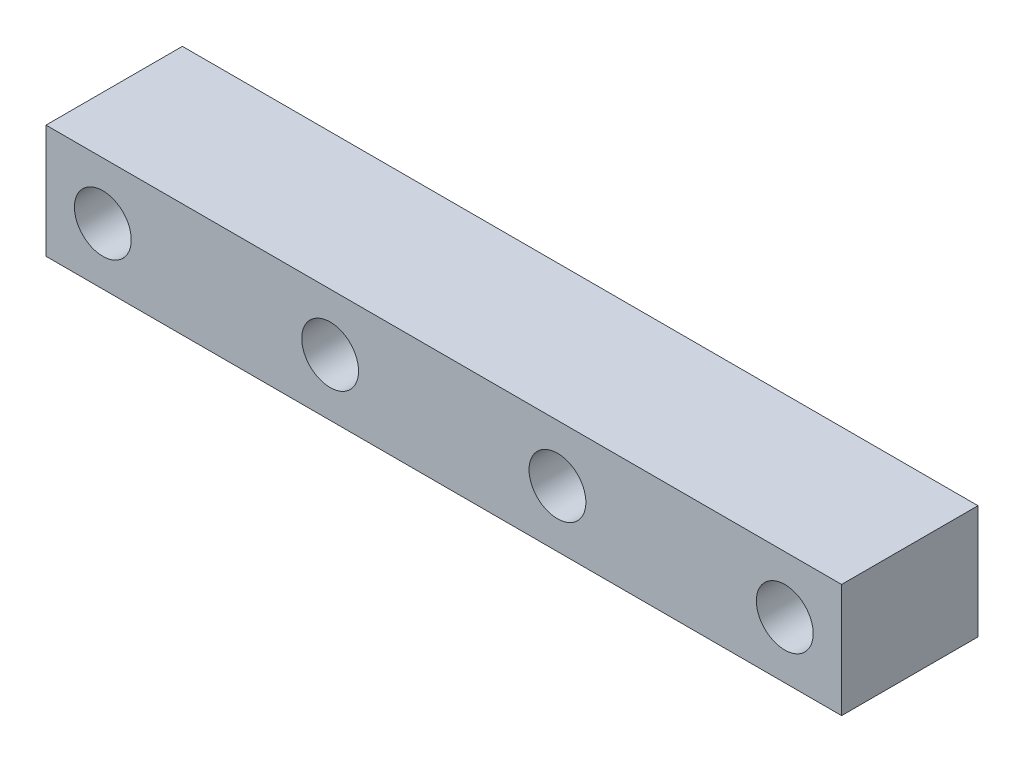
ISO-10303-21;
HEADER;
FILE_DESCRIPTION(('STEP AP214'),'2;1');
FILE_NAME('part.step','',(''),(''),'','','');
FILE_SCHEMA(('AUTOMOTIVE_DESIGN { 1 0 10303 214 1 1 1 1 }'));
ENDSEC;
DATA;
#1=APPLICATION_CONTEXT('core data for automotive mechanical design processes');
#2=APPLICATION_PROTOCOL_DEFINITION('international standard','automotive_design',2000,#1);
#3=PRODUCT_CONTEXT('',#1,'mechanical');
#4=PRODUCT('Part','Part','',(#3));
#5=PRODUCT_RELATED_PRODUCT_CATEGORY('part','',(#4));
#6=PRODUCT_DEFINITION_FORMATION('','',#4);
#7=PRODUCT_DEFINITION_CONTEXT('part definition',#1,'design');
#8=PRODUCT_DEFINITION('design','',#6,#7);
#9=PRODUCT_DEFINITION_SHAPE('','',#8);
#10=(LENGTH_UNIT() NAMED_UNIT(*) SI_UNIT(.MILLI.,.METRE.));
#11=(NAMED_UNIT(*) PLANE_ANGLE_UNIT() SI_UNIT($,.RADIAN.));
#12=(NAMED_UNIT(*) SI_UNIT($,.STERADIAN.) SOLID_ANGLE_UNIT());
#13=UNCERTAINTY_MEASURE_WITH_UNIT(LENGTH_MEASURE(1.E-05),#10,'distance_accuracy_value','');
#14=(GEOMETRIC_REPRESENTATION_CONTEXT(3) GLOBAL_UNCERTAINTY_ASSIGNED_CONTEXT((#13)) GLOBAL_UNIT_ASSIGNED_CONTEXT((#10,
#11,#12)) REPRESENTATION_CONTEXT('',''));
#15=CARTESIAN_POINT('',(0.,0.,0.));
#16=DIRECTION('',(0.,0.,1.));
#17=DIRECTION('',(1.,0.,0.));
#18=AXIS2_PLACEMENT_3D('',#15,#16,#17);
#19=CARTESIAN_POINT('',(22.225,-3.175,7.62));
#20=DIRECTION('',(-1.,0.,0.));
#21=DIRECTION('',(0.,0.,1.));
#22=AXIS2_PLACEMENT_3D('',#19,#20,#21);
#23=PLANE('',#22);
#24=DIRECTION('',(0.,1.,0.));
#25=VECTOR('',#24,1.);
#26=CARTESIAN_POINT('',(22.225,-3.175,0.));
#27=LINE('',#26,#25);
#28=CARTESIAN_POINT('',(22.225,-3.175,0.));
#29=VERTEX_POINT('',#28);
#30=CARTESIAN_POINT('',(22.225,3.175,0.));
#31=VERTEX_POINT('',#30);
#32=EDGE_CURVE('E111',#29,#31,#27,.T.);
#33=ORIENTED_EDGE('',*,*,#32,.T.);
#34=DIRECTION('',(0.,0.,-1.));
#35=VECTOR('',#34,1.);
#36=CARTESIAN_POINT('',(22.225,3.175,7.62));
#37=LINE('',#36,#35);
#38=CARTESIAN_POINT('',(22.225,3.175,7.62));
#39=VERTEX_POINT('',#38);
#40=EDGE_CURVE('E11',#39,#31,#37,.T.);
#41=ORIENTED_EDGE('',*,*,#40,.F.);
#42=DIRECTION('',(0.,1.,0.));
#43=VECTOR('',#42,1.);
#44=CARTESIAN_POINT('',(22.225,-3.175,7.62));
#45=LINE('',#44,#43);
#46=CARTESIAN_POINT('',(22.225,-3.175,7.62));
#47=VERTEX_POINT('',#46);
#48=EDGE_CURVE('E95',#47,#39,#45,.T.);
#49=ORIENTED_EDGE('',*,*,#48,.F.);
#50=DIRECTION('',(0.,0.,-1.));
#51=VECTOR('',#50,1.);
#52=CARTESIAN_POINT('',(22.225,-3.175,7.62));
#53=LINE('',#52,#51);
#54=EDGE_CURVE('E107',#47,#29,#53,.T.);
#55=ORIENTED_EDGE('',*,*,#54,.T.);
#56=EDGE_LOOP('',(#33,#41,#49,#55));
#57=FACE_BOUND('',#56,.T.);
#58=ADVANCED_FACE('F43',(#57),#23,.F.);
#59=CARTESIAN_POINT('',(-22.225,3.175,7.62));
#60=DIRECTION('',(0.,-1.,0.));
#61=DIRECTION('',(0.,0.,-1.));
#62=AXIS2_PLACEMENT_3D('',#59,#60,#61);
#63=PLANE('',#62);
#64=DIRECTION('',(-1.,0.,0.));
#65=VECTOR('',#64,1.);
#66=CARTESIAN_POINT('',(-22.225,3.175,0.));
#67=LINE('',#66,#65);
#68=CARTESIAN_POINT('',(-22.225,3.175,0.));
#69=VERTEX_POINT('',#68);
#70=EDGE_CURVE('E100',#31,#69,#67,.T.);
#71=ORIENTED_EDGE('',*,*,#70,.T.);
#72=DIRECTION('',(0.,0.,-1.));
#73=VECTOR('',#72,1.);
#74=CARTESIAN_POINT('',(-22.225,3.175,7.62));
#75=LINE('',#74,#73);
#76=CARTESIAN_POINT('',(-22.225,3.175,7.62));
#77=VERTEX_POINT('',#76);
#78=EDGE_CURVE('E52',#77,#69,#75,.T.);
#79=ORIENTED_EDGE('',*,*,#78,.F.);
#80=DIRECTION('',(-1.,0.,0.));
#81=VECTOR('',#80,1.);
#82=CARTESIAN_POINT('',(-22.225,3.175,7.62));
#83=LINE('',#82,#81);
#84=EDGE_CURVE('E90',#39,#77,#83,.T.);
#85=ORIENTED_EDGE('',*,*,#84,.F.);
#86=ORIENTED_EDGE('',*,*,#40,.T.);
#87=EDGE_LOOP('',(#71,#79,#85,#86));
#88=FACE_BOUND('',#87,.T.);
#89=ADVANCED_FACE('F99',(#88),#63,.F.);
#90=CARTESIAN_POINT('',(-22.225,-3.175,7.62));
#91=DIRECTION('',(1.,0.,0.));
#92=DIRECTION('',(0.,0.,-1.));
#93=AXIS2_PLACEMENT_3D('',#90,#91,#92);
#94=PLANE('',#93);
#95=DIRECTION('',(0.,-1.,0.));
#96=VECTOR('',#95,1.);
#97=CARTESIAN_POINT('',(-22.225,-3.175,0.));
#98=LINE('',#97,#96);
#99=CARTESIAN_POINT('',(-22.225,-3.175,0.));
#100=VERTEX_POINT('',#99);
#101=EDGE_CURVE('E77',#69,#100,#98,.T.);
#102=ORIENTED_EDGE('',*,*,#101,.T.);
#103=DIRECTION('',(0.,0.,-1.));
#104=VECTOR('',#103,1.);
#105=CARTESIAN_POINT('',(-22.225,-3.175,7.62));
#106=LINE('',#105,#104);
#107=CARTESIAN_POINT('',(-22.225,-3.175,7.62));
#108=VERTEX_POINT('',#107);
#109=EDGE_CURVE('E102',#108,#100,#106,.T.);
#110=ORIENTED_EDGE('',*,*,#109,.F.);
#111=DIRECTION('',(0.,-1.,0.));
#112=VECTOR('',#111,1.);
#113=CARTESIAN_POINT('',(-22.225,-3.175,7.62));
#114=LINE('',#113,#112);
#115=EDGE_CURVE('E93',#77,#108,#114,.T.);
#116=ORIENTED_EDGE('',*,*,#115,.F.);
#117=ORIENTED_EDGE('',*,*,#78,.T.);
#118=EDGE_LOOP('',(#102,#110,#116,#117));
#119=FACE_BOUND('',#118,.T.);
#120=ADVANCED_FACE('F103',(#119),#94,.F.);
#121=CARTESIAN_POINT('',(-22.225,-3.175,7.62));
#122=DIRECTION('',(0.,1.,0.));
#123=DIRECTION('',(0.,0.,1.));
#124=AXIS2_PLACEMENT_3D('',#121,#122,#123);
#125=PLANE('',#124);
#126=DIRECTION('',(1.,0.,0.));
#127=VECTOR('',#126,1.);
#128=CARTESIAN_POINT('',(-22.225,-3.175,0.));
#129=LINE('',#128,#127);
#130=EDGE_CURVE('E83',#100,#29,#129,.T.);
#131=ORIENTED_EDGE('',*,*,#130,.T.);
#132=ORIENTED_EDGE('',*,*,#54,.F.);
#133=DIRECTION('',(1.,0.,0.));
#134=VECTOR('',#133,1.);
#135=CARTESIAN_POINT('',(-22.225,-3.175,7.62));
#136=LINE('',#135,#134);
#137=EDGE_CURVE('E60',#108,#47,#136,.T.);
#138=ORIENTED_EDGE('',*,*,#137,.F.);
#139=ORIENTED_EDGE('',*,*,#109,.T.);
#140=EDGE_LOOP('',(#131,#132,#138,#139));
#141=FACE_BOUND('',#140,.T.);
#142=ADVANCED_FACE('F125',(#141),#125,.F.);
#143=CARTESIAN_POINT('',(0.,0.,7.62));
#144=DIRECTION('',(0.,0.,-1.));
#145=DIRECTION('',(-1.,0.,0.));
#146=AXIS2_PLACEMENT_3D('',#143,#144,#145);
#147=PLANE('',#146);
#148=CARTESIAN_POINT('',(-6.35,0.,7.62));
#149=DIRECTION('',(0.,0.,1.));
#150=DIRECTION('',(1.,0.,0.));
#151=AXIS2_PLACEMENT_3D('',#148,#149,#150);
#152=CIRCLE('',#151,1.5875);
#153=CARTESIAN_POINT('',(-4.7625,0.,7.62));
#154=VERTEX_POINT('',#153);
#155=EDGE_CURVE('E137',#154,#154,#152,.T.);
#156=ORIENTED_EDGE('',*,*,#155,.F.);
#157=EDGE_LOOP('',(#156));
#158=FACE_BOUND('',#157,.T.);
#159=CARTESIAN_POINT('',(-19.05,0.,7.62));
#160=DIRECTION('',(0.,0.,1.));
#161=DIRECTION('',(1.,0.,0.));
#162=AXIS2_PLACEMENT_3D('',#159,#160,#161);
#163=CIRCLE('',#162,1.5875);
#164=CARTESIAN_POINT('',(-17.4625,0.,7.62));
#165=VERTEX_POINT('',#164);
#166=EDGE_CURVE('E152',#165,#165,#163,.T.);
#167=ORIENTED_EDGE('',*,*,#166,.F.);
#168=EDGE_LOOP('',(#167));
#169=FACE_BOUND('',#168,.T.);
#170=CARTESIAN_POINT('',(6.35,0.,7.62));
#171=DIRECTION('',(0.,0.,-1.));
#172=DIRECTION('',(-1.,0.,0.));
#173=AXIS2_PLACEMENT_3D('',#170,#171,#172);
#174=CIRCLE('',#173,1.5875);
#175=CARTESIAN_POINT('',(4.7625,0.,7.62));
#176=VERTEX_POINT('',#175);
#177=EDGE_CURVE('E115',#176,#176,#174,.T.);
#178=ORIENTED_EDGE('',*,*,#177,.T.);
#179=EDGE_LOOP('',(#178));
#180=FACE_BOUND('',#179,.T.);
#181=CARTESIAN_POINT('',(19.05,0.,7.62));
#182=DIRECTION('',(0.,0.,-1.));
#183=DIRECTION('',(-1.,0.,0.));
#184=AXIS2_PLACEMENT_3D('',#181,#182,#183);
#185=CIRCLE('',#184,1.5875);
#186=CARTESIAN_POINT('',(17.4625,0.,7.62));
#187=VERTEX_POINT('',#186);
#188=EDGE_CURVE('E132',#187,#187,#185,.T.);
#189=ORIENTED_EDGE('',*,*,#188,.T.);
#190=EDGE_LOOP('',(#189));
#191=FACE_BOUND('',#190,.T.);
#192=ORIENTED_EDGE('',*,*,#48,.T.);
#193=ORIENTED_EDGE('',*,*,#84,.T.);
#194=ORIENTED_EDGE('',*,*,#115,.T.);
#195=ORIENTED_EDGE('',*,*,#137,.T.);
#196=EDGE_LOOP('',(#192,#193,#194,#195));
#197=FACE_BOUND('',#196,.T.);
#198=ADVANCED_FACE('F91',(#158,#169,#180,#191,#197),#147,.F.);
#199=CARTESIAN_POINT('',(0.,0.,0.));
#200=DIRECTION('',(0.,0.,-1.));
#201=DIRECTION('',(-1.,0.,0.));
#202=AXIS2_PLACEMENT_3D('',#199,#200,#201);
#203=PLANE('',#202);
#204=CARTESIAN_POINT('',(-6.35,0.,0.));
#205=DIRECTION('',(0.,0.,1.));
#206=DIRECTION('',(1.,0.,0.));
#207=AXIS2_PLACEMENT_3D('',#204,#205,#206);
#208=CIRCLE('',#207,1.5875);
#209=CARTESIAN_POINT('',(-4.7625,0.,0.));
#210=VERTEX_POINT('',#209);
#211=EDGE_CURVE('E156',#210,#210,#208,.T.);
#212=ORIENTED_EDGE('',*,*,#211,.T.);
#213=EDGE_LOOP('',(#212));
#214=FACE_BOUND('',#213,.T.);
#215=CARTESIAN_POINT('',(-19.05,0.,0.));
#216=DIRECTION('',(0.,0.,1.));
#217=DIRECTION('',(1.,0.,0.));
#218=AXIS2_PLACEMENT_3D('',#215,#216,#217);
#219=CIRCLE('',#218,1.5875);
#220=CARTESIAN_POINT('',(-17.4625,0.,0.));
#221=VERTEX_POINT('',#220);
#222=EDGE_CURVE('E148',#221,#221,#219,.T.);
#223=ORIENTED_EDGE('',*,*,#222,.T.);
#224=EDGE_LOOP('',(#223));
#225=FACE_BOUND('',#224,.T.);
#226=CARTESIAN_POINT('',(6.35,0.,0.));
#227=DIRECTION('',(0.,0.,-1.));
#228=DIRECTION('',(-1.,0.,0.));
#229=AXIS2_PLACEMENT_3D('',#226,#227,#228);
#230=CIRCLE('',#229,1.5875);
#231=CARTESIAN_POINT('',(4.7625,0.,0.));
#232=VERTEX_POINT('',#231);
#233=EDGE_CURVE('E141',#232,#232,#230,.T.);
#234=ORIENTED_EDGE('',*,*,#233,.F.);
#235=EDGE_LOOP('',(#234));
#236=FACE_BOUND('',#235,.T.);
#237=CARTESIAN_POINT('',(19.05,0.,0.));
#238=DIRECTION('',(0.,0.,-1.));
#239=DIRECTION('',(-1.,0.,0.));
#240=AXIS2_PLACEMENT_3D('',#237,#238,#239);
#241=CIRCLE('',#240,1.5875);
#242=CARTESIAN_POINT('',(17.4625,0.,0.));
#243=VERTEX_POINT('',#242);
#244=EDGE_CURVE('E136',#243,#243,#241,.T.);
#245=ORIENTED_EDGE('',*,*,#244,.F.);
#246=EDGE_LOOP('',(#245));
#247=FACE_BOUND('',#246,.T.);
#248=ORIENTED_EDGE('',*,*,#32,.F.);
#249=ORIENTED_EDGE('',*,*,#130,.F.);
#250=ORIENTED_EDGE('',*,*,#101,.F.);
#251=ORIENTED_EDGE('',*,*,#70,.F.);
#252=EDGE_LOOP('',(#248,#249,#250,#251));
#253=FACE_BOUND('',#252,.T.);
#254=ADVANCED_FACE('F128',(#214,#225,#236,#247,#253),#203,.T.);
#255=CARTESIAN_POINT('',(19.05,0.,7.62));
#256=DIRECTION('',(0.,0.,-1.));
#257=DIRECTION('',(-1.,0.,0.));
#258=AXIS2_PLACEMENT_3D('',#255,#256,#257);
#259=CYLINDRICAL_SURFACE('',#258,1.5875);
#260=ORIENTED_EDGE('',*,*,#188,.F.);
#261=EDGE_LOOP('',(#260));
#262=FACE_BOUND('',#261,.T.);
#263=ORIENTED_EDGE('',*,*,#244,.T.);
#264=EDGE_LOOP('',(#263));
#265=FACE_BOUND('',#264,.T.);
#266=ADVANCED_FACE('F176',(#262,#265),#259,.F.);
#267=CARTESIAN_POINT('',(6.35,0.,7.62));
#268=DIRECTION('',(0.,0.,-1.));
#269=DIRECTION('',(-1.,0.,0.));
#270=AXIS2_PLACEMENT_3D('',#267,#268,#269);
#271=CYLINDRICAL_SURFACE('',#270,1.5875);
#272=ORIENTED_EDGE('',*,*,#177,.F.);
#273=EDGE_LOOP('',(#272));
#274=FACE_BOUND('',#273,.T.);
#275=ORIENTED_EDGE('',*,*,#233,.T.);
#276=EDGE_LOOP('',(#275));
#277=FACE_BOUND('',#276,.T.);
#278=ADVANCED_FACE('F179',(#274,#277),#271,.F.);
#279=CARTESIAN_POINT('',(-19.05,0.,7.62));
#280=DIRECTION('',(0.,0.,-1.));
#281=DIRECTION('',(-1.,0.,0.));
#282=AXIS2_PLACEMENT_3D('',#279,#280,#281);
#283=CYLINDRICAL_SURFACE('',#282,1.5875);
#284=ORIENTED_EDGE('',*,*,#166,.T.);
#285=EDGE_LOOP('',(#284));
#286=FACE_BOUND('',#285,.T.);
#287=ORIENTED_EDGE('',*,*,#222,.F.);
#288=EDGE_LOOP('',(#287));
#289=FACE_BOUND('',#288,.T.);
#290=ADVANCED_FACE('F224',(#286,#289),#283,.F.);
#291=CARTESIAN_POINT('',(-6.35,0.,7.62));
#292=DIRECTION('',(0.,0.,-1.));
#293=DIRECTION('',(-1.,0.,0.));
#294=AXIS2_PLACEMENT_3D('',#291,#292,#293);
#295=CYLINDRICAL_SURFACE('',#294,1.5875);
#296=ORIENTED_EDGE('',*,*,#155,.T.);
#297=EDGE_LOOP('',(#296));
#298=FACE_BOUND('',#297,.T.);
#299=ORIENTED_EDGE('',*,*,#211,.F.);
#300=EDGE_LOOP('',(#299));
#301=FACE_BOUND('',#300,.T.);
#302=ADVANCED_FACE('F164',(#298,#301),#295,.F.);
#303=CLOSED_SHELL('',(#58,#89,#120,#142,#198,#254,#266,#278,#290,#302));
#304=MANIFOLD_SOLID_BREP('B2',#303);
#305=ADVANCED_BREP_SHAPE_REPRESENTATION('',(#18,#304),#14);
#306=SHAPE_DEFINITION_REPRESENTATION(#9,#305);
ENDSEC;
END-ISO-10303-21;
